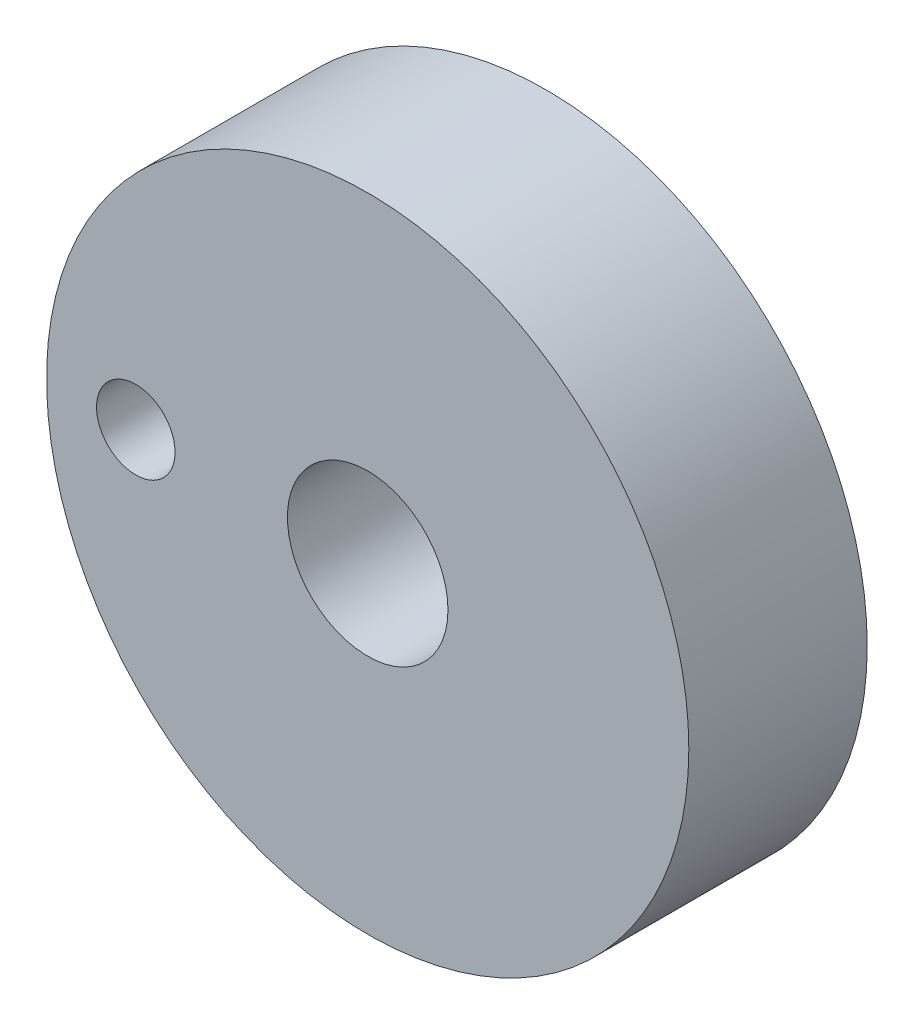
ISO-10303-21;
HEADER;
FILE_DESCRIPTION(('STEP AP214'),'2;1');
FILE_NAME('part.step','',(''),(''),'','','');
FILE_SCHEMA(('AUTOMOTIVE_DESIGN { 1 0 10303 214 1 1 1 1 }'));
ENDSEC;
DATA;
#1=APPLICATION_CONTEXT('core data for automotive mechanical design processes');
#2=APPLICATION_PROTOCOL_DEFINITION('international standard','automotive_design',2000,#1);
#3=PRODUCT_CONTEXT('',#1,'mechanical');
#4=PRODUCT('Part','Part','',(#3));
#5=PRODUCT_RELATED_PRODUCT_CATEGORY('part','',(#4));
#6=PRODUCT_DEFINITION_FORMATION('','',#4);
#7=PRODUCT_DEFINITION_CONTEXT('part definition',#1,'design');
#8=PRODUCT_DEFINITION('design','',#6,#7);
#9=PRODUCT_DEFINITION_SHAPE('','',#8);
#10=(LENGTH_UNIT() NAMED_UNIT(*) SI_UNIT(.MILLI.,.METRE.));
#11=(NAMED_UNIT(*) PLANE_ANGLE_UNIT() SI_UNIT($,.RADIAN.));
#12=(NAMED_UNIT(*) SI_UNIT($,.STERADIAN.) SOLID_ANGLE_UNIT());
#13=UNCERTAINTY_MEASURE_WITH_UNIT(LENGTH_MEASURE(1.E-05),#10,'distance_accuracy_value','');
#14=(GEOMETRIC_REPRESENTATION_CONTEXT(3) GLOBAL_UNCERTAINTY_ASSIGNED_CONTEXT((#13)) GLOBAL_UNIT_ASSIGNED_CONTEXT((#10,
#11,#12)) REPRESENTATION_CONTEXT('',''));
#15=CARTESIAN_POINT('',(0.,0.,0.));
#16=DIRECTION('',(0.,0.,1.));
#17=DIRECTION('',(1.,0.,0.));
#18=AXIS2_PLACEMENT_3D('',#15,#16,#17);
#19=CARTESIAN_POINT('',(0.,0.,5.));
#20=DIRECTION('',(0.,0.,1.));
#21=DIRECTION('',(1.,0.,0.));
#22=AXIS2_PLACEMENT_3D('',#19,#20,#21);
#23=PLANE('',#22);
#24=CARTESIAN_POINT('',(0.,0.,5.));
#25=DIRECTION('',(0.,0.,1.));
#26=DIRECTION('',(1.,0.,0.));
#27=AXIS2_PLACEMENT_3D('',#24,#25,#26);
#28=CIRCLE('',#27,2.25);
#29=CARTESIAN_POINT('',(2.25,0.,5.));
#30=VERTEX_POINT('',#29);
#31=EDGE_CURVE('E44',#30,#30,#28,.T.);
#32=ORIENTED_EDGE('',*,*,#31,.F.);
#33=EDGE_LOOP('',(#32));
#34=FACE_BOUND('',#33,.T.);
#35=CARTESIAN_POINT('',(0.,0.,5.));
#36=DIRECTION('',(0.,0.,1.));
#37=DIRECTION('',(1.,0.,0.));
#38=AXIS2_PLACEMENT_3D('',#35,#36,#37);
#39=CIRCLE('',#38,9.);
#40=CARTESIAN_POINT('',(9.,0.,5.));
#41=VERTEX_POINT('',#40);
#42=EDGE_CURVE('E10',#41,#41,#39,.T.);
#43=ORIENTED_EDGE('',*,*,#42,.T.);
#44=EDGE_LOOP('',(#43));
#45=FACE_BOUND('',#44,.T.);
#46=CARTESIAN_POINT('',(-6.5,0.,5.));
#47=DIRECTION('',(0.,0.,1.));
#48=DIRECTION('',(1.,0.,0.));
#49=AXIS2_PLACEMENT_3D('',#46,#47,#48);
#50=CIRCLE('',#49,1.1);
#51=CARTESIAN_POINT('',(-5.4,0.,5.));
#52=VERTEX_POINT('',#51);
#53=EDGE_CURVE('E49',#52,#52,#50,.T.);
#54=ORIENTED_EDGE('',*,*,#53,.F.);
#55=EDGE_LOOP('',(#54));
#56=FACE_BOUND('',#55,.T.);
#57=ADVANCED_FACE('F33',(#34,#45,#56),#23,.T.);
#58=CARTESIAN_POINT('',(0.,0.,0.));
#59=DIRECTION('',(0.,0.,1.));
#60=DIRECTION('',(1.,0.,0.));
#61=AXIS2_PLACEMENT_3D('',#58,#59,#60);
#62=PLANE('',#61);
#63=CARTESIAN_POINT('',(0.,0.,0.));
#64=DIRECTION('',(0.,0.,1.));
#65=DIRECTION('',(1.,0.,0.));
#66=AXIS2_PLACEMENT_3D('',#63,#64,#65);
#67=CIRCLE('',#66,2.25);
#68=CARTESIAN_POINT('',(2.25,0.,0.));
#69=VERTEX_POINT('',#68);
#70=EDGE_CURVE('E46',#69,#69,#67,.T.);
#71=ORIENTED_EDGE('',*,*,#70,.T.);
#72=EDGE_LOOP('',(#71));
#73=FACE_BOUND('',#72,.T.);
#74=CARTESIAN_POINT('',(0.,0.,0.));
#75=DIRECTION('',(0.,0.,1.));
#76=DIRECTION('',(1.,0.,0.));
#77=AXIS2_PLACEMENT_3D('',#74,#75,#76);
#78=CIRCLE('',#77,9.);
#79=CARTESIAN_POINT('',(9.,0.,0.));
#80=VERTEX_POINT('',#79);
#81=EDGE_CURVE('E37',#80,#80,#78,.T.);
#82=ORIENTED_EDGE('',*,*,#81,.F.);
#83=EDGE_LOOP('',(#82));
#84=FACE_BOUND('',#83,.T.);
#85=CARTESIAN_POINT('',(-6.5,0.,0.));
#86=DIRECTION('',(0.,0.,1.));
#87=DIRECTION('',(1.,0.,0.));
#88=AXIS2_PLACEMENT_3D('',#85,#86,#87);
#89=CIRCLE('',#88,1.1);
#90=CARTESIAN_POINT('',(-5.4,0.,0.));
#91=VERTEX_POINT('',#90);
#92=EDGE_CURVE('E52',#91,#91,#89,.T.);
#93=ORIENTED_EDGE('',*,*,#92,.T.);
#94=EDGE_LOOP('',(#93));
#95=FACE_BOUND('',#94,.T.);
#96=ADVANCED_FACE('F62',(#73,#84,#95),#62,.F.);
#97=CARTESIAN_POINT('',(0.,0.,5.));
#98=DIRECTION('',(0.,0.,-1.));
#99=DIRECTION('',(-1.,0.,0.));
#100=AXIS2_PLACEMENT_3D('',#97,#98,#99);
#101=CYLINDRICAL_SURFACE('',#100,9.);
#102=ORIENTED_EDGE('',*,*,#42,.F.);
#103=EDGE_LOOP('',(#102));
#104=FACE_BOUND('',#103,.T.);
#105=ORIENTED_EDGE('',*,*,#81,.T.);
#106=EDGE_LOOP('',(#105));
#107=FACE_BOUND('',#106,.T.);
#108=ADVANCED_FACE('F35',(#104,#107),#101,.T.);
#109=CARTESIAN_POINT('',(0.,0.,5.));
#110=DIRECTION('',(0.,0.,-1.));
#111=DIRECTION('',(-1.,0.,0.));
#112=AXIS2_PLACEMENT_3D('',#109,#110,#111);
#113=CYLINDRICAL_SURFACE('',#112,2.25);
#114=ORIENTED_EDGE('',*,*,#31,.T.);
#115=EDGE_LOOP('',(#114));
#116=FACE_BOUND('',#115,.T.);
#117=ORIENTED_EDGE('',*,*,#70,.F.);
#118=EDGE_LOOP('',(#117));
#119=FACE_BOUND('',#118,.T.);
#120=ADVANCED_FACE('F71',(#116,#119),#113,.F.);
#121=CARTESIAN_POINT('',(-6.5,0.,5.));
#122=DIRECTION('',(0.,0.,-1.));
#123=DIRECTION('',(-1.,0.,0.));
#124=AXIS2_PLACEMENT_3D('',#121,#122,#123);
#125=CYLINDRICAL_SURFACE('',#124,1.1);
#126=ORIENTED_EDGE('',*,*,#53,.T.);
#127=EDGE_LOOP('',(#126));
#128=FACE_BOUND('',#127,.T.);
#129=ORIENTED_EDGE('',*,*,#92,.F.);
#130=EDGE_LOOP('',(#129));
#131=FACE_BOUND('',#130,.T.);
#132=ADVANCED_FACE('F58',(#128,#131),#125,.F.);
#133=CLOSED_SHELL('',(#57,#96,#108,#120,#132));
#134=MANIFOLD_SOLID_BREP('B2',#133);
#135=ADVANCED_BREP_SHAPE_REPRESENTATION('',(#18,#134),#14);
#136=SHAPE_DEFINITION_REPRESENTATION(#9,#135);
ENDSEC;
END-ISO-10303-21;
